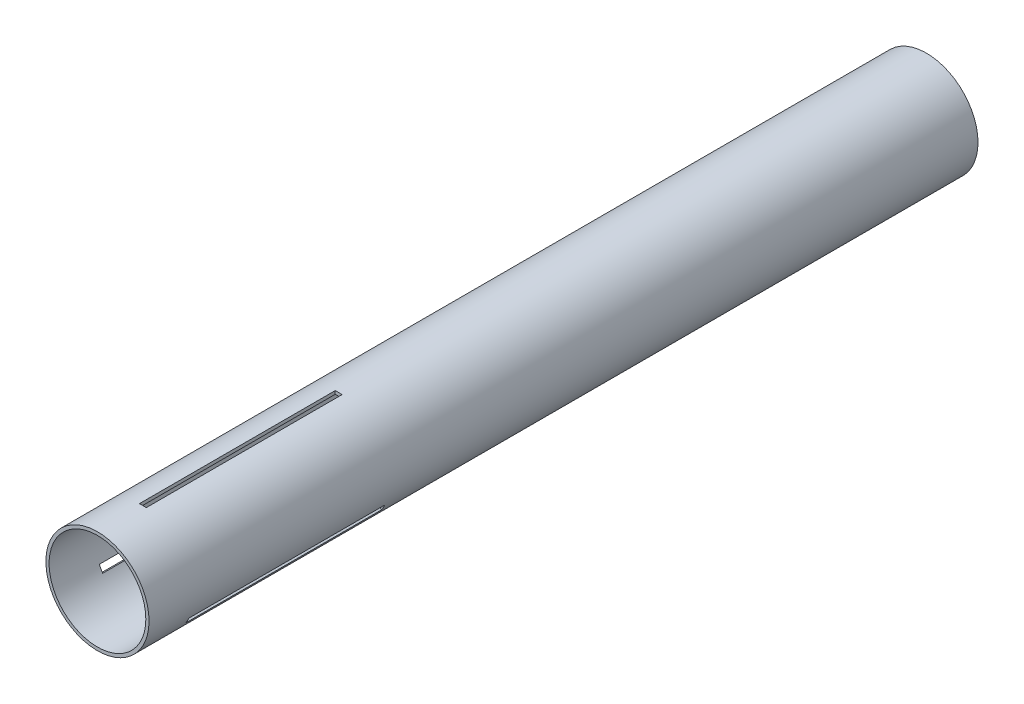
ISO-10303-21;
HEADER;
FILE_DESCRIPTION(('STEP AP214'),'2;1');
FILE_NAME('part.step','',(''),(''),'','','');
FILE_SCHEMA(('AUTOMOTIVE_DESIGN { 1 0 10303 214 1 1 1 1 }'));
ENDSEC;
DATA;
#1=APPLICATION_CONTEXT('core data for automotive mechanical design processes');
#2=APPLICATION_PROTOCOL_DEFINITION('international standard','automotive_design',2000,#1);
#3=PRODUCT_CONTEXT('',#1,'mechanical');
#4=PRODUCT('Part','Part','',(#3));
#5=PRODUCT_RELATED_PRODUCT_CATEGORY('part','',(#4));
#6=PRODUCT_DEFINITION_FORMATION('','',#4);
#7=PRODUCT_DEFINITION_CONTEXT('part definition',#1,'design');
#8=PRODUCT_DEFINITION('design','',#6,#7);
#9=PRODUCT_DEFINITION_SHAPE('','',#8);
#10=(LENGTH_UNIT() NAMED_UNIT(*) SI_UNIT(.MILLI.,.METRE.));
#11=(NAMED_UNIT(*) PLANE_ANGLE_UNIT() SI_UNIT($,.RADIAN.));
#12=(NAMED_UNIT(*) SI_UNIT($,.STERADIAN.) SOLID_ANGLE_UNIT());
#13=UNCERTAINTY_MEASURE_WITH_UNIT(LENGTH_MEASURE(1.E-05),#10,'distance_accuracy_value','');
#14=(GEOMETRIC_REPRESENTATION_CONTEXT(3) GLOBAL_UNCERTAINTY_ASSIGNED_CONTEXT((#13)) GLOBAL_UNIT_ASSIGNED_CONTEXT((#10,
#11,#12)) REPRESENTATION_CONTEXT('',''));
#15=CARTESIAN_POINT('',(0.,0.,0.));
#16=DIRECTION('',(0.,0.,1.));
#17=DIRECTION('',(1.,0.,0.));
#18=AXIS2_PLACEMENT_3D('',#15,#16,#17);
#19=CARTESIAN_POINT('',(0.,0.,381.));
#20=DIRECTION('',(0.,0.,1.));
#21=DIRECTION('',(1.,0.,0.));
#22=AXIS2_PLACEMENT_3D('',#19,#20,#21);
#23=PLANE('',#22);
#24=CARTESIAN_POINT('',(0.,0.,381.));
#25=DIRECTION('',(0.,0.,1.));
#26=DIRECTION('',(1.,0.,0.));
#27=AXIS2_PLACEMENT_3D('',#24,#25,#26);
#28=CIRCLE('',#27,23.6982);
#29=CARTESIAN_POINT('',(23.6982,0.,381.));
#30=VERTEX_POINT('',#29);
#31=EDGE_CURVE('E11',#30,#30,#28,.T.);
#32=ORIENTED_EDGE('',*,*,#31,.T.);
#33=EDGE_LOOP('',(#32));
#34=FACE_BOUND('',#33,.T.);
#35=CARTESIAN_POINT('',(0.,0.,381.));
#36=DIRECTION('',(0.,0.,1.));
#37=DIRECTION('',(1.,0.,0.));
#38=AXIS2_PLACEMENT_3D('',#35,#36,#37);
#39=CIRCLE('',#38,22.225);
#40=CARTESIAN_POINT('',(22.225,0.,381.));
#41=VERTEX_POINT('',#40);
#42=EDGE_CURVE('E225',#41,#41,#39,.T.);
#43=ORIENTED_EDGE('',*,*,#42,.F.);
#44=EDGE_LOOP('',(#43));
#45=FACE_BOUND('',#44,.T.);
#46=ADVANCED_FACE('F33',(#34,#45),#23,.T.);
#47=CARTESIAN_POINT('',(0.,0.,0.));
#48=DIRECTION('',(0.,0.,1.));
#49=DIRECTION('',(1.,0.,0.));
#50=AXIS2_PLACEMENT_3D('',#47,#48,#49);
#51=PLANE('',#50);
#52=CARTESIAN_POINT('',(0.,0.,0.));
#53=DIRECTION('',(0.,0.,1.));
#54=DIRECTION('',(1.,0.,0.));
#55=AXIS2_PLACEMENT_3D('',#52,#53,#54);
#56=CIRCLE('',#55,23.6982);
#57=CARTESIAN_POINT('',(23.6982,0.,0.));
#58=VERTEX_POINT('',#57);
#59=EDGE_CURVE('E37',#58,#58,#56,.T.);
#60=ORIENTED_EDGE('',*,*,#59,.F.);
#61=EDGE_LOOP('',(#60));
#62=FACE_BOUND('',#61,.T.);
#63=CARTESIAN_POINT('',(0.,0.,0.));
#64=DIRECTION('',(0.,0.,1.));
#65=DIRECTION('',(1.,0.,0.));
#66=AXIS2_PLACEMENT_3D('',#63,#64,#65);
#67=CIRCLE('',#66,22.225);
#68=CARTESIAN_POINT('',(22.225,0.,0.));
#69=VERTEX_POINT('',#68);
#70=EDGE_CURVE('E224',#69,#69,#67,.T.);
#71=ORIENTED_EDGE('',*,*,#70,.T.);
#72=EDGE_LOOP('',(#71));
#73=FACE_BOUND('',#72,.T.);
#74=ADVANCED_FACE('F231',(#62,#73),#51,.F.);
#75=CARTESIAN_POINT('',(0.,0.,381.));
#76=DIRECTION('',(0.,0.,-1.));
#77=DIRECTION('',(-1.,0.,0.));
#78=AXIS2_PLACEMENT_3D('',#75,#76,#77);
#79=CYLINDRICAL_SURFACE('',#78,23.6982);
#80=CARTESIAN_POINT('',(0.,0.,270.1720022));
#81=DIRECTION('',(0.,0.,-1.));
#82=DIRECTION('',(0.,1.,0.));
#83=AXIS2_PLACEMENT_3D('',#80,#81,#82);
#84=CIRCLE('',#83,23.6982);
#85=CARTESIAN_POINT('',(19.6833932392926,-13.1972994899476,270.1720022));
#86=VERTEX_POINT('',#85);
#87=CARTESIAN_POINT('',(21.2708932392925,-10.447668832932,270.1720022));
#88=VERTEX_POINT('',#87);
#89=EDGE_CURVE('E138',#86,#88,#84,.F.);
#90=ORIENTED_EDGE('',*,*,#89,.F.);
#91=DIRECTION('',(0.,0.,-1.));
#92=VECTOR('',#91,1.);
#93=CARTESIAN_POINT('',(19.6833932392926,-13.1972994899476,381.));
#94=LINE('',#93,#92);
#95=CARTESIAN_POINT('',(19.6833932392926,-13.1972994899476,360.172));
#96=VERTEX_POINT('',#95);
#97=EDGE_CURVE('E159',#96,#86,#94,.T.);
#98=ORIENTED_EDGE('',*,*,#97,.F.);
#99=CARTESIAN_POINT('',(0.,0.,360.172));
#100=DIRECTION('',(0.,0.,1.));
#101=DIRECTION('',(0.,-1.,0.));
#102=AXIS2_PLACEMENT_3D('',#99,#100,#101);
#103=CIRCLE('',#102,23.6982);
#104=CARTESIAN_POINT('',(21.2708932392925,-10.447668832932,360.172));
#105=VERTEX_POINT('',#104);
#106=EDGE_CURVE('E151',#105,#96,#103,.F.);
#107=ORIENTED_EDGE('',*,*,#106,.F.);
#108=DIRECTION('',(0.,0.,-1.));
#109=VECTOR('',#108,1.);
#110=CARTESIAN_POINT('',(21.2708932392925,-10.447668832932,381.));
#111=LINE('',#110,#109);
#112=EDGE_CURVE('E48',#88,#105,#111,.F.);
#113=ORIENTED_EDGE('',*,*,#112,.F.);
#114=EDGE_LOOP('',(#90,#98,#107,#113));
#115=FACE_BOUND('',#114,.T.);
#116=CARTESIAN_POINT('',(0.,0.,270.1720022));
#117=DIRECTION('',(0.,0.,-1.));
#118=DIRECTION('',(0.,1.,0.));
#119=AXIS2_PLACEMENT_3D('',#116,#117,#118);
#120=CIRCLE('',#119,23.6982);
#121=CARTESIAN_POINT('',(-21.2708932392924,-10.4476688329323,270.1720022));
#122=VERTEX_POINT('',#121);
#123=CARTESIAN_POINT('',(-19.6833932392924,-13.1972994899479,270.1720022));
#124=VERTEX_POINT('',#123);
#125=EDGE_CURVE('E171',#122,#124,#120,.F.);
#126=ORIENTED_EDGE('',*,*,#125,.F.);
#127=DIRECTION('',(0.,0.,-1.));
#128=VECTOR('',#127,1.);
#129=CARTESIAN_POINT('',(-21.2708932392924,-10.4476688329323,381.));
#130=LINE('',#129,#128);
#131=CARTESIAN_POINT('',(-21.2708932392924,-10.4476688329323,360.172));
#132=VERTEX_POINT('',#131);
#133=EDGE_CURVE('E189',#132,#122,#130,.T.);
#134=ORIENTED_EDGE('',*,*,#133,.F.);
#135=CARTESIAN_POINT('',(0.,0.,360.172));
#136=DIRECTION('',(0.,0.,1.));
#137=DIRECTION('',(0.,-1.,0.));
#138=AXIS2_PLACEMENT_3D('',#135,#136,#137);
#139=CIRCLE('',#138,23.6982);
#140=CARTESIAN_POINT('',(-19.6833932392924,-13.1972994899479,360.172));
#141=VERTEX_POINT('',#140);
#142=EDGE_CURVE('E175',#141,#132,#139,.F.);
#143=ORIENTED_EDGE('',*,*,#142,.F.);
#144=DIRECTION('',(0.,0.,-1.));
#145=VECTOR('',#144,1.);
#146=CARTESIAN_POINT('',(-19.6833932392924,-13.1972994899479,381.));
#147=LINE('',#146,#145);
#148=EDGE_CURVE('E56',#124,#141,#147,.F.);
#149=ORIENTED_EDGE('',*,*,#148,.F.);
#150=EDGE_LOOP('',(#126,#134,#143,#149));
#151=FACE_BOUND('',#150,.T.);
#152=CARTESIAN_POINT('',(0.,0.,270.1720022));
#153=DIRECTION('',(0.,0.,-1.));
#154=DIRECTION('',(-1.,0.,0.));
#155=AXIS2_PLACEMENT_3D('',#152,#153,#154);
#156=CIRCLE('',#155,23.6982);
#157=CARTESIAN_POINT('',(1.5875,23.64496832288,270.1720022));
#158=VERTEX_POINT('',#157);
#159=CARTESIAN_POINT('',(-1.5875,23.64496832288,270.1720022));
#160=VERTEX_POINT('',#159);
#161=EDGE_CURVE('E201',#158,#160,#156,.F.);
#162=ORIENTED_EDGE('',*,*,#161,.F.);
#163=DIRECTION('',(0.,0.,-1.));
#164=VECTOR('',#163,1.);
#165=CARTESIAN_POINT('',(1.5875,23.64496832288,381.));
#166=LINE('',#165,#164);
#167=CARTESIAN_POINT('',(1.5875,23.64496832288,360.172));
#168=VERTEX_POINT('',#167);
#169=EDGE_CURVE('E221',#168,#158,#166,.T.);
#170=ORIENTED_EDGE('',*,*,#169,.F.);
#171=CARTESIAN_POINT('',(0.,0.,360.172));
#172=DIRECTION('',(0.,0.,1.));
#173=DIRECTION('',(1.,0.,0.));
#174=AXIS2_PLACEMENT_3D('',#171,#172,#173);
#175=CIRCLE('',#174,23.6982);
#176=CARTESIAN_POINT('',(-1.5875,23.64496832288,360.172));
#177=VERTEX_POINT('',#176);
#178=EDGE_CURVE('E205',#177,#168,#175,.F.);
#179=ORIENTED_EDGE('',*,*,#178,.F.);
#180=DIRECTION('',(0.,0.,-1.));
#181=VECTOR('',#180,1.);
#182=CARTESIAN_POINT('',(-1.5875,23.64496832288,381.));
#183=LINE('',#182,#181);
#184=EDGE_CURVE('E203',#160,#177,#183,.F.);
#185=ORIENTED_EDGE('',*,*,#184,.F.);
#186=EDGE_LOOP('',(#162,#170,#179,#185));
#187=FACE_BOUND('',#186,.T.);
#188=ORIENTED_EDGE('',*,*,#31,.F.);
#189=EDGE_LOOP('',(#188));
#190=FACE_BOUND('',#189,.T.);
#191=ORIENTED_EDGE('',*,*,#59,.T.);
#192=EDGE_LOOP('',(#191));
#193=FACE_BOUND('',#192,.T.);
#194=ADVANCED_FACE('F35',(#115,#151,#187,#190,#193),#79,.T.);
#195=CARTESIAN_POINT('',(0.,0.,381.));
#196=DIRECTION('',(0.,0.,-1.));
#197=DIRECTION('',(-1.,0.,0.));
#198=AXIS2_PLACEMENT_3D('',#195,#196,#197);
#199=CYLINDRICAL_SURFACE('',#198,22.225);
#200=DIRECTION('',(0.,0.,-1.));
#201=VECTOR('',#200,1.);
#202=CARTESIAN_POINT('',(18.404501263136,-12.4589308632492,381.));
#203=LINE('',#202,#201);
#204=CARTESIAN_POINT('',(18.404501263136,-12.4589308632492,360.172));
#205=VERTEX_POINT('',#204);
#206=CARTESIAN_POINT('',(18.4045012631361,-12.4589308632492,270.1720022));
#207=VERTEX_POINT('',#206);
#208=EDGE_CURVE('E145',#205,#207,#203,.T.);
#209=ORIENTED_EDGE('',*,*,#208,.T.);
#210=CARTESIAN_POINT('',(0.,0.,270.1720022));
#211=DIRECTION('',(0.,0.,-1.));
#212=DIRECTION('',(0.,1.,0.));
#213=AXIS2_PLACEMENT_3D('',#210,#211,#212);
#214=CIRCLE('',#213,22.225);
#215=CARTESIAN_POINT('',(19.992001263136,-9.70930020623361,270.1720022));
#216=VERTEX_POINT('',#215);
#217=EDGE_CURVE('E132',#207,#216,#214,.F.);
#218=ORIENTED_EDGE('',*,*,#217,.T.);
#219=DIRECTION('',(0.,0.,-1.));
#220=VECTOR('',#219,1.);
#221=CARTESIAN_POINT('',(19.992001263136,-9.70930020623361,381.));
#222=LINE('',#221,#220);
#223=CARTESIAN_POINT('',(19.992001263136,-9.70930020623361,360.172));
#224=VERTEX_POINT('',#223);
#225=EDGE_CURVE('E122',#216,#224,#222,.F.);
#226=ORIENTED_EDGE('',*,*,#225,.T.);
#227=CARTESIAN_POINT('',(0.,0.,360.172));
#228=DIRECTION('',(0.,0.,1.));
#229=DIRECTION('',(0.,-1.,0.));
#230=AXIS2_PLACEMENT_3D('',#227,#228,#229);
#231=CIRCLE('',#230,22.225);
#232=EDGE_CURVE('E131',#224,#205,#231,.F.);
#233=ORIENTED_EDGE('',*,*,#232,.T.);
#234=EDGE_LOOP('',(#209,#218,#226,#233));
#235=FACE_BOUND('',#234,.T.);
#236=DIRECTION('',(0.,0.,-1.));
#237=VECTOR('',#236,1.);
#238=CARTESIAN_POINT('',(-19.9920012631359,-9.70930020623389,381.));
#239=LINE('',#238,#237);
#240=CARTESIAN_POINT('',(-19.9920012631359,-9.70930020623389,360.172));
#241=VERTEX_POINT('',#240);
#242=CARTESIAN_POINT('',(-19.9920012631359,-9.7093002062339,270.1720022));
#243=VERTEX_POINT('',#242);
#244=EDGE_CURVE('E181',#241,#243,#239,.T.);
#245=ORIENTED_EDGE('',*,*,#244,.T.);
#246=CARTESIAN_POINT('',(0.,0.,270.1720022));
#247=DIRECTION('',(0.,0.,-1.));
#248=DIRECTION('',(0.,1.,0.));
#249=AXIS2_PLACEMENT_3D('',#246,#247,#248);
#250=CIRCLE('',#249,22.225);
#251=CARTESIAN_POINT('',(-18.4045012631359,-12.4589308632495,270.1720022));
#252=VERTEX_POINT('',#251);
#253=EDGE_CURVE('E162',#243,#252,#250,.F.);
#254=ORIENTED_EDGE('',*,*,#253,.T.);
#255=DIRECTION('',(0.,0.,-1.));
#256=VECTOR('',#255,1.);
#257=CARTESIAN_POINT('',(-18.4045012631359,-12.4589308632495,381.));
#258=LINE('',#257,#256);
#259=CARTESIAN_POINT('',(-18.4045012631359,-12.4589308632495,360.172));
#260=VERTEX_POINT('',#259);
#261=EDGE_CURVE('E165',#252,#260,#258,.F.);
#262=ORIENTED_EDGE('',*,*,#261,.T.);
#263=CARTESIAN_POINT('',(0.,0.,360.172));
#264=DIRECTION('',(0.,0.,1.));
#265=DIRECTION('',(0.,-1.,0.));
#266=AXIS2_PLACEMENT_3D('',#263,#264,#265);
#267=CIRCLE('',#266,22.225);
#268=EDGE_CURVE('E168',#260,#241,#267,.F.);
#269=ORIENTED_EDGE('',*,*,#268,.T.);
#270=EDGE_LOOP('',(#245,#254,#262,#269));
#271=FACE_BOUND('',#270,.T.);
#272=DIRECTION('',(0.,0.,-1.));
#273=VECTOR('',#272,1.);
#274=CARTESIAN_POINT('',(1.5875,22.1682310694832,381.));
#275=LINE('',#274,#273);
#276=CARTESIAN_POINT('',(1.5875,22.1682310694832,360.172));
#277=VERTEX_POINT('',#276);
#278=CARTESIAN_POINT('',(1.5875,22.1682310694832,270.1720022));
#279=VERTEX_POINT('',#278);
#280=EDGE_CURVE('E211',#277,#279,#275,.T.);
#281=ORIENTED_EDGE('',*,*,#280,.T.);
#282=CARTESIAN_POINT('',(0.,0.,270.1720022));
#283=DIRECTION('',(0.,0.,-1.));
#284=DIRECTION('',(-1.,0.,0.));
#285=AXIS2_PLACEMENT_3D('',#282,#283,#284);
#286=CIRCLE('',#285,22.225);
#287=CARTESIAN_POINT('',(-1.5875,22.1682310694832,270.1720022));
#288=VERTEX_POINT('',#287);
#289=EDGE_CURVE('E192',#279,#288,#286,.F.);
#290=ORIENTED_EDGE('',*,*,#289,.T.);
#291=DIRECTION('',(0.,0.,-1.));
#292=VECTOR('',#291,1.);
#293=CARTESIAN_POINT('',(-1.5875,22.1682310694832,381.));
#294=LINE('',#293,#292);
#295=CARTESIAN_POINT('',(-1.5875,22.1682310694832,360.172));
#296=VERTEX_POINT('',#295);
#297=EDGE_CURVE('E195',#288,#296,#294,.F.);
#298=ORIENTED_EDGE('',*,*,#297,.T.);
#299=CARTESIAN_POINT('',(0.,0.,360.172));
#300=DIRECTION('',(0.,0.,1.));
#301=DIRECTION('',(1.,0.,0.));
#302=AXIS2_PLACEMENT_3D('',#299,#300,#301);
#303=CIRCLE('',#302,22.225);
#304=EDGE_CURVE('E198',#296,#277,#303,.F.);
#305=ORIENTED_EDGE('',*,*,#304,.T.);
#306=EDGE_LOOP('',(#281,#290,#298,#305));
#307=FACE_BOUND('',#306,.T.);
#308=ORIENTED_EDGE('',*,*,#42,.T.);
#309=EDGE_LOOP('',(#308));
#310=FACE_BOUND('',#309,.T.);
#311=ORIENTED_EDGE('',*,*,#70,.F.);
#312=EDGE_LOOP('',(#311));
#313=FACE_BOUND('',#312,.T.);
#314=ADVANCED_FACE('F142',(#235,#271,#307,#310,#313),#199,.F.);
#315=CARTESIAN_POINT('',(1.5875,-23.6992,360.172));
#316=DIRECTION('',(1.,0.,0.));
#317=DIRECTION('',(0.,0.,-1.));
#318=AXIS2_PLACEMENT_3D('',#315,#316,#317);
#319=PLANE('',#318);
#320=ORIENTED_EDGE('',*,*,#169,.T.);
#321=DIRECTION('',(0.,1.,0.));
#322=VECTOR('',#321,1.);
#323=CARTESIAN_POINT('',(1.5875,-23.6992,270.1720022));
#324=LINE('',#323,#322);
#325=EDGE_CURVE('E215',#279,#158,#324,.T.);
#326=ORIENTED_EDGE('',*,*,#325,.F.);
#327=ORIENTED_EDGE('',*,*,#280,.F.);
#328=DIRECTION('',(0.,1.,0.));
#329=VECTOR('',#328,1.);
#330=CARTESIAN_POINT('',(1.5875,-23.6992,360.172));
#331=LINE('',#330,#329);
#332=EDGE_CURVE('E207',#277,#168,#331,.T.);
#333=ORIENTED_EDGE('',*,*,#332,.T.);
#334=EDGE_LOOP('',(#320,#326,#327,#333));
#335=FACE_BOUND('',#334,.T.);
#336=ADVANCED_FACE('F234',(#335),#319,.F.);
#337=CARTESIAN_POINT('',(-1.5875,-23.6992,270.1720022));
#338=DIRECTION('',(0.,0.,-1.));
#339=DIRECTION('',(-1.,0.,0.));
#340=AXIS2_PLACEMENT_3D('',#337,#338,#339);
#341=PLANE('',#340);
#342=ORIENTED_EDGE('',*,*,#161,.T.);
#343=DIRECTION('',(0.,1.,0.));
#344=VECTOR('',#343,1.);
#345=CARTESIAN_POINT('',(-1.5875,-23.6992,270.1720022));
#346=LINE('',#345,#344);
#347=EDGE_CURVE('E212',#288,#160,#346,.T.);
#348=ORIENTED_EDGE('',*,*,#347,.F.);
#349=ORIENTED_EDGE('',*,*,#289,.F.);
#350=ORIENTED_EDGE('',*,*,#325,.T.);
#351=EDGE_LOOP('',(#342,#348,#349,#350));
#352=FACE_BOUND('',#351,.T.);
#353=ADVANCED_FACE('F240',(#352),#341,.F.);
#354=CARTESIAN_POINT('',(-1.5875,-23.6992,360.172));
#355=DIRECTION('',(-1.,0.,0.));
#356=DIRECTION('',(0.,0.,1.));
#357=AXIS2_PLACEMENT_3D('',#354,#355,#356);
#358=PLANE('',#357);
#359=ORIENTED_EDGE('',*,*,#184,.T.);
#360=DIRECTION('',(0.,1.,0.));
#361=VECTOR('',#360,1.);
#362=CARTESIAN_POINT('',(-1.5875,-23.6992,360.172));
#363=LINE('',#362,#361);
#364=EDGE_CURVE('E208',#296,#177,#363,.T.);
#365=ORIENTED_EDGE('',*,*,#364,.F.);
#366=ORIENTED_EDGE('',*,*,#297,.F.);
#367=ORIENTED_EDGE('',*,*,#347,.T.);
#368=EDGE_LOOP('',(#359,#365,#366,#367));
#369=FACE_BOUND('',#368,.T.);
#370=ADVANCED_FACE('F358',(#369),#358,.F.);
#371=CARTESIAN_POINT('',(-1.5875,-23.6992,360.172));
#372=DIRECTION('',(0.,0.,1.));
#373=DIRECTION('',(1.,0.,0.));
#374=AXIS2_PLACEMENT_3D('',#371,#372,#373);
#375=PLANE('',#374);
#376=ORIENTED_EDGE('',*,*,#178,.T.);
#377=ORIENTED_EDGE('',*,*,#332,.F.);
#378=ORIENTED_EDGE('',*,*,#304,.F.);
#379=ORIENTED_EDGE('',*,*,#364,.T.);
#380=EDGE_LOOP('',(#376,#377,#378,#379));
#381=FACE_BOUND('',#380,.T.);
#382=ADVANCED_FACE('F273',(#381),#375,.F.);
#383=CARTESIAN_POINT('',(27.242704624684,17.561669953192,360.172));
#384=DIRECTION('',(-0.500000000000004,0.866025403784436,0.));
#385=DIRECTION('',(-0.866025403784436,-0.500000000000004,0.));
#386=AXIS2_PLACEMENT_3D('',#383,#384,#385);
#387=PLANE('',#386);
#388=ORIENTED_EDGE('',*,*,#133,.T.);
#389=DIRECTION('',(-0.866025403784436,-0.500000000000004,0.));
#390=VECTOR('',#389,1.);
#391=CARTESIAN_POINT('',(27.242704624684,17.561669953192,270.1720022));
#392=LINE('',#391,#390);
#393=EDGE_CURVE('E184',#243,#122,#392,.T.);
#394=ORIENTED_EDGE('',*,*,#393,.F.);
#395=ORIENTED_EDGE('',*,*,#244,.F.);
#396=DIRECTION('',(-0.866025403784436,-0.500000000000004,0.));
#397=VECTOR('',#396,1.);
#398=CARTESIAN_POINT('',(27.242704624684,17.561669953192,360.172));
#399=LINE('',#398,#397);
#400=EDGE_CURVE('E178',#241,#132,#399,.T.);
#401=ORIENTED_EDGE('',*,*,#400,.T.);
#402=EDGE_LOOP('',(#388,#394,#395,#401));
#403=FACE_BOUND('',#402,.T.);
#404=ADVANCED_FACE('F283',(#403),#387,.F.);
#405=CARTESIAN_POINT('',(28.830204624684,14.8120392961764,270.1720022));
#406=DIRECTION('',(0.,0.,-1.));
#407=DIRECTION('',(0.,1.,0.));
#408=AXIS2_PLACEMENT_3D('',#405,#406,#407);
#409=PLANE('',#408);
#410=ORIENTED_EDGE('',*,*,#125,.T.);
#411=DIRECTION('',(-0.866025403784436,-0.500000000000004,0.));
#412=VECTOR('',#411,1.);
#413=CARTESIAN_POINT('',(28.830204624684,14.8120392961764,270.1720022));
#414=LINE('',#413,#412);
#415=EDGE_CURVE('E182',#252,#124,#414,.T.);
#416=ORIENTED_EDGE('',*,*,#415,.F.);
#417=ORIENTED_EDGE('',*,*,#253,.F.);
#418=ORIENTED_EDGE('',*,*,#393,.T.);
#419=EDGE_LOOP('',(#410,#416,#417,#418));
#420=FACE_BOUND('',#419,.T.);
#421=ADVANCED_FACE('F288',(#420),#409,.F.);
#422=CARTESIAN_POINT('',(28.830204624684,14.8120392961764,360.172));
#423=DIRECTION('',(0.500000000000004,-0.866025403784436,0.));
#424=DIRECTION('',(0.866025403784436,0.500000000000004,0.));
#425=AXIS2_PLACEMENT_3D('',#422,#423,#424);
#426=PLANE('',#425);
#427=ORIENTED_EDGE('',*,*,#148,.T.);
#428=DIRECTION('',(-0.866025403784436,-0.500000000000004,0.));
#429=VECTOR('',#428,1.);
#430=CARTESIAN_POINT('',(28.830204624684,14.8120392961764,360.172));
#431=LINE('',#430,#429);
#432=EDGE_CURVE('E179',#260,#141,#431,.T.);
#433=ORIENTED_EDGE('',*,*,#432,.F.);
#434=ORIENTED_EDGE('',*,*,#261,.F.);
#435=ORIENTED_EDGE('',*,*,#415,.T.);
#436=EDGE_LOOP('',(#427,#433,#434,#435));
#437=FACE_BOUND('',#436,.T.);
#438=ADVANCED_FACE('F298',(#437),#426,.F.);
#439=CARTESIAN_POINT('',(28.830204624684,14.8120392961764,360.172));
#440=DIRECTION('',(0.,0.,1.));
#441=DIRECTION('',(0.,-1.,0.));
#442=AXIS2_PLACEMENT_3D('',#439,#440,#441);
#443=PLANE('',#442);
#444=ORIENTED_EDGE('',*,*,#142,.T.);
#445=ORIENTED_EDGE('',*,*,#400,.F.);
#446=ORIENTED_EDGE('',*,*,#268,.F.);
#447=ORIENTED_EDGE('',*,*,#432,.T.);
#448=EDGE_LOOP('',(#444,#445,#446,#447));
#449=FACE_BOUND('',#448,.T.);
#450=ADVANCED_FACE('F308',(#449),#443,.F.);
#451=CARTESIAN_POINT('',(-28.8302046246841,14.812039296176,360.172));
#452=DIRECTION('',(-0.499999999999992,-0.866025403784443,0.));
#453=DIRECTION('',(0.866025403784443,-0.499999999999992,0.));
#454=AXIS2_PLACEMENT_3D('',#451,#452,#453);
#455=PLANE('',#454);
#456=ORIENTED_EDGE('',*,*,#97,.T.);
#457=DIRECTION('',(0.866025403784443,-0.499999999999992,0.));
#458=VECTOR('',#457,1.);
#459=CARTESIAN_POINT('',(-28.8302046246841,14.812039296176,270.1720022));
#460=LINE('',#459,#458);
#461=EDGE_CURVE('E139',#207,#86,#460,.T.);
#462=ORIENTED_EDGE('',*,*,#461,.F.);
#463=ORIENTED_EDGE('',*,*,#208,.F.);
#464=DIRECTION('',(0.866025403784443,-0.499999999999992,0.));
#465=VECTOR('',#464,1.);
#466=CARTESIAN_POINT('',(-28.8302046246841,14.812039296176,360.172));
#467=LINE('',#466,#465);
#468=EDGE_CURVE('E154',#205,#96,#467,.T.);
#469=ORIENTED_EDGE('',*,*,#468,.T.);
#470=EDGE_LOOP('',(#456,#462,#463,#469));
#471=FACE_BOUND('',#470,.T.);
#472=ADVANCED_FACE('F317',(#471),#455,.F.);
#473=CARTESIAN_POINT('',(-27.2427046246842,17.5616699531916,270.1720022));
#474=DIRECTION('',(0.,0.,-1.));
#475=DIRECTION('',(0.,1.,0.));
#476=AXIS2_PLACEMENT_3D('',#473,#474,#475);
#477=PLANE('',#476);
#478=ORIENTED_EDGE('',*,*,#89,.T.);
#479=DIRECTION('',(0.866025403784443,-0.499999999999992,0.));
#480=VECTOR('',#479,1.);
#481=CARTESIAN_POINT('',(-27.2427046246842,17.5616699531916,270.1720022));
#482=LINE('',#481,#480);
#483=EDGE_CURVE('E125',#216,#88,#482,.T.);
#484=ORIENTED_EDGE('',*,*,#483,.F.);
#485=ORIENTED_EDGE('',*,*,#217,.F.);
#486=ORIENTED_EDGE('',*,*,#461,.T.);
#487=EDGE_LOOP('',(#478,#484,#485,#486));
#488=FACE_BOUND('',#487,.T.);
#489=ADVANCED_FACE('F135',(#488),#477,.F.);
#490=CARTESIAN_POINT('',(-27.2427046246842,17.5616699531916,360.172));
#491=DIRECTION('',(0.499999999999992,0.866025403784443,0.));
#492=DIRECTION('',(-0.866025403784443,0.499999999999992,0.));
#493=AXIS2_PLACEMENT_3D('',#490,#491,#492);
#494=PLANE('',#493);
#495=ORIENTED_EDGE('',*,*,#112,.T.);
#496=DIRECTION('',(0.866025403784443,-0.499999999999992,0.));
#497=VECTOR('',#496,1.);
#498=CARTESIAN_POINT('',(-27.2427046246842,17.5616699531916,360.172));
#499=LINE('',#498,#497);
#500=EDGE_CURVE('E127',#224,#105,#499,.T.);
#501=ORIENTED_EDGE('',*,*,#500,.F.);
#502=ORIENTED_EDGE('',*,*,#225,.F.);
#503=ORIENTED_EDGE('',*,*,#483,.T.);
#504=EDGE_LOOP('',(#495,#501,#502,#503));
#505=FACE_BOUND('',#504,.T.);
#506=ADVANCED_FACE('F124',(#505),#494,.F.);
#507=CARTESIAN_POINT('',(-27.2427046246842,17.5616699531916,360.172));
#508=DIRECTION('',(0.,0.,1.));
#509=DIRECTION('',(0.,-1.,0.));
#510=AXIS2_PLACEMENT_3D('',#507,#508,#509);
#511=PLANE('',#510);
#512=ORIENTED_EDGE('',*,*,#106,.T.);
#513=ORIENTED_EDGE('',*,*,#468,.F.);
#514=ORIENTED_EDGE('',*,*,#232,.F.);
#515=ORIENTED_EDGE('',*,*,#500,.T.);
#516=EDGE_LOOP('',(#512,#513,#514,#515));
#517=FACE_BOUND('',#516,.T.);
#518=ADVANCED_FACE('F344',(#517),#511,.F.);
#519=CLOSED_SHELL('',(#46,#74,#194,#314,#336,#353,#370,#382,#404,#421,#438,#450,#472,#489,#506,#518));
#520=MANIFOLD_SOLID_BREP('B2',#519);
#521=ADVANCED_BREP_SHAPE_REPRESENTATION('',(#18,#520),#14);
#522=SHAPE_DEFINITION_REPRESENTATION(#9,#521);
ENDSEC;
END-ISO-10303-21;
